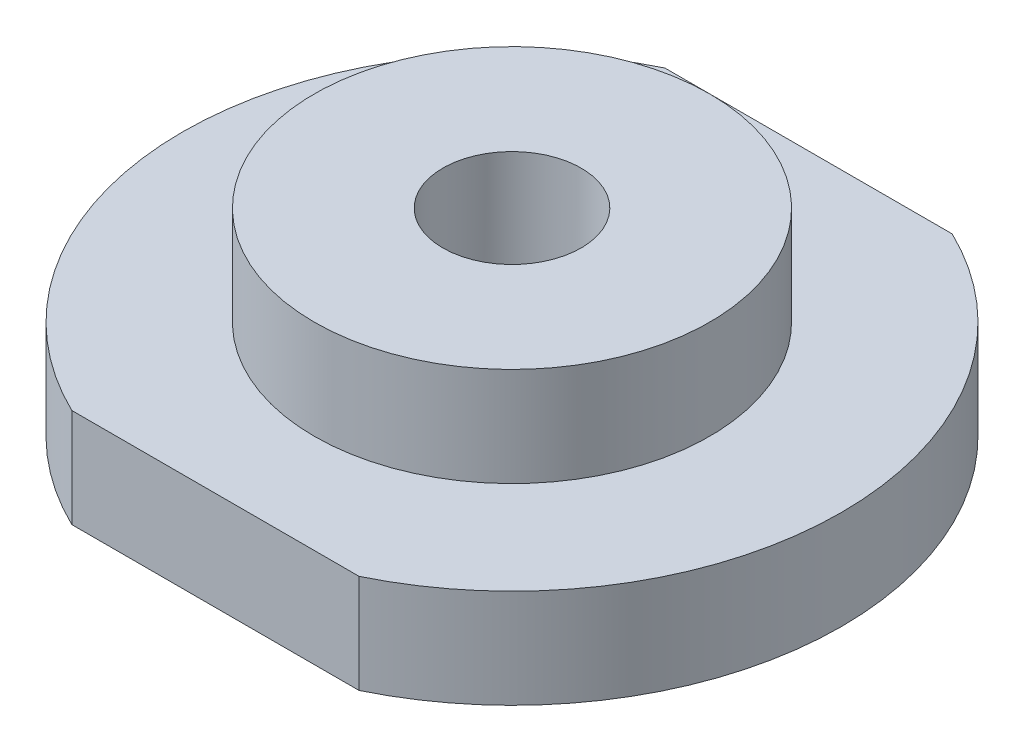
ISO-10303-21;
HEADER;
FILE_DESCRIPTION(('STEP AP214'),'2;1');
FILE_NAME('part.step','',(''),(''),'','','');
FILE_SCHEMA(('AUTOMOTIVE_DESIGN { 1 0 10303 214 1 1 1 1 }'));
ENDSEC;
DATA;
#1=APPLICATION_CONTEXT('core data for automotive mechanical design processes');
#2=APPLICATION_PROTOCOL_DEFINITION('international standard','automotive_design',2000,#1);
#3=PRODUCT_CONTEXT('',#1,'mechanical');
#4=PRODUCT('Part','Part','',(#3));
#5=PRODUCT_RELATED_PRODUCT_CATEGORY('part','',(#4));
#6=PRODUCT_DEFINITION_FORMATION('','',#4);
#7=PRODUCT_DEFINITION_CONTEXT('part definition',#1,'design');
#8=PRODUCT_DEFINITION('design','',#6,#7);
#9=PRODUCT_DEFINITION_SHAPE('','',#8);
#10=(LENGTH_UNIT() NAMED_UNIT(*) SI_UNIT(.MILLI.,.METRE.));
#11=(NAMED_UNIT(*) PLANE_ANGLE_UNIT() SI_UNIT($,.RADIAN.));
#12=(NAMED_UNIT(*) SI_UNIT($,.STERADIAN.) SOLID_ANGLE_UNIT());
#13=UNCERTAINTY_MEASURE_WITH_UNIT(LENGTH_MEASURE(1.E-05),#10,'distance_accuracy_value','');
#14=(GEOMETRIC_REPRESENTATION_CONTEXT(3) GLOBAL_UNCERTAINTY_ASSIGNED_CONTEXT((#13)) GLOBAL_UNIT_ASSIGNED_CONTEXT((#10,
#11,#12)) REPRESENTATION_CONTEXT('',''));
#15=CARTESIAN_POINT('',(0.,0.,0.));
#16=DIRECTION('',(0.,0.,1.));
#17=DIRECTION('',(1.,0.,0.));
#18=AXIS2_PLACEMENT_3D('',#15,#16,#17);
#19=CARTESIAN_POINT('',(0.,8.,0.));
#20=DIRECTION('',(0.,-1.,0.));
#21=DIRECTION('',(0.,0.,-1.));
#22=AXIS2_PLACEMENT_3D('',#19,#20,#21);
#23=CYLINDRICAL_SURFACE('',#22,10.);
#24=CARTESIAN_POINT('',(0.,3.,0.));
#25=DIRECTION('',(0.,1.,0.));
#26=DIRECTION('',(0.,0.,1.));
#27=AXIS2_PLACEMENT_3D('',#24,#25,#26);
#28=CIRCLE('',#27,10.);
#29=CARTESIAN_POINT('',(4.35889894354067,3.,9.));
#30=VERTEX_POINT('',#29);
#31=CARTESIAN_POINT('',(4.35889894354067,3.,-9.));
#32=VERTEX_POINT('',#31);
#33=EDGE_CURVE('E138',#30,#32,#28,.T.);
#34=ORIENTED_EDGE('',*,*,#33,.F.);
#35=DIRECTION('',(0.,-1.,0.));
#36=VECTOR('',#35,1.);
#37=CARTESIAN_POINT('',(4.35889894354067,10.,9.));
#38=LINE('',#37,#36);
#39=CARTESIAN_POINT('',(4.35889894354067,0.,9.));
#40=VERTEX_POINT('',#39);
#41=EDGE_CURVE('E63',#30,#40,#38,.T.);
#42=ORIENTED_EDGE('',*,*,#41,.T.);
#43=CARTESIAN_POINT('',(0.,0.,0.));
#44=DIRECTION('',(0.,1.,0.));
#45=DIRECTION('',(0.,0.,1.));
#46=AXIS2_PLACEMENT_3D('',#43,#44,#45);
#47=CIRCLE('',#46,10.);
#48=CARTESIAN_POINT('',(4.35889894354067,0.,-9.));
#49=VERTEX_POINT('',#48);
#50=EDGE_CURVE('E132',#40,#49,#47,.T.);
#51=ORIENTED_EDGE('',*,*,#50,.T.);
#52=DIRECTION('',(0.,-1.,0.));
#53=VECTOR('',#52,1.);
#54=CARTESIAN_POINT('',(4.35889894354067,10.,-9.));
#55=LINE('',#54,#53);
#56=EDGE_CURVE('E134',#32,#49,#55,.T.);
#57=ORIENTED_EDGE('',*,*,#56,.F.);
#58=EDGE_LOOP('',(#34,#42,#51,#57));
#59=FACE_BOUND('',#58,.T.);
#60=ADVANCED_FACE('F41',(#59),#23,.T.);
#61=CARTESIAN_POINT('',(-4.35889894354067,0.,-9.));
#62=VERTEX_POINT('',#61);
#63=CARTESIAN_POINT('',(-4.35889894354067,0.,9.));
#64=VERTEX_POINT('',#63);
#65=EDGE_CURVE('E130',#62,#64,#47,.T.);
#66=ORIENTED_EDGE('',*,*,#65,.T.);
#67=DIRECTION('',(0.,-1.,0.));
#68=VECTOR('',#67,1.);
#69=CARTESIAN_POINT('',(-4.35889894354067,10.,9.));
#70=LINE('',#69,#68);
#71=CARTESIAN_POINT('',(-4.35889894354067,3.,9.));
#72=VERTEX_POINT('',#71);
#73=EDGE_CURVE('E115',#72,#64,#70,.T.);
#74=ORIENTED_EDGE('',*,*,#73,.F.);
#75=CARTESIAN_POINT('',(-4.35889894354067,3.,-9.));
#76=VERTEX_POINT('',#75);
#77=EDGE_CURVE('E143',#76,#72,#28,.T.);
#78=ORIENTED_EDGE('',*,*,#77,.F.);
#79=DIRECTION('',(0.,-1.,0.));
#80=VECTOR('',#79,1.);
#81=CARTESIAN_POINT('',(-4.35889894354067,10.,-9.));
#82=LINE('',#81,#80);
#83=EDGE_CURVE('E56',#76,#62,#82,.T.);
#84=ORIENTED_EDGE('',*,*,#83,.T.);
#85=EDGE_LOOP('',(#66,#74,#78,#84));
#86=FACE_BOUND('',#85,.T.);
#87=ADVANCED_FACE('F136',(#86),#23,.T.);
#88=CARTESIAN_POINT('',(0.,0.,0.));
#89=DIRECTION('',(0.,1.,0.));
#90=DIRECTION('',(0.,0.,1.));
#91=AXIS2_PLACEMENT_3D('',#88,#89,#90);
#92=PLANE('',#91);
#93=DIRECTION('',(-0.874157276121538,0.,0.485642931178632));
#94=VECTOR('',#93,1.);
#95=CARTESIAN_POINT('',(-1.74056603773585,0.,-3.13301886792453));
#96=LINE('',#95,#94);
#97=CARTESIAN_POINT('',(0.,0.,-4.1));
#98=VERTEX_POINT('',#97);
#99=CARTESIAN_POINT('',(-3.6,0.,-2.1));
#100=VERTEX_POINT('',#99);
#101=EDGE_CURVE('E218',#98,#100,#96,.T.);
#102=ORIENTED_EDGE('',*,*,#101,.T.);
#103=DIRECTION('',(0.,0.,-1.));
#104=VECTOR('',#103,1.);
#105=CARTESIAN_POINT('',(-3.6,0.,0.));
#106=LINE('',#105,#104);
#107=CARTESIAN_POINT('',(-3.6,0.,2.1));
#108=VERTEX_POINT('',#107);
#109=EDGE_CURVE('E221',#108,#100,#106,.T.);
#110=ORIENTED_EDGE('',*,*,#109,.F.);
#111=DIRECTION('',(-0.874157276121538,0.,-0.485642931178632));
#112=VECTOR('',#111,1.);
#113=CARTESIAN_POINT('',(-1.74056603773585,0.,3.13301886792453));
#114=LINE('',#113,#112);
#115=CARTESIAN_POINT('',(0.,0.,4.1));
#116=VERTEX_POINT('',#115);
#117=EDGE_CURVE('E225',#116,#108,#114,.T.);
#118=ORIENTED_EDGE('',*,*,#117,.F.);
#119=DIRECTION('',(-0.874157276121538,0.,0.485642931178632));
#120=VECTOR('',#119,1.);
#121=CARTESIAN_POINT('',(1.74056603773585,0.,3.13301886792453));
#122=LINE('',#121,#120);
#123=CARTESIAN_POINT('',(3.6,0.,2.1));
#124=VERTEX_POINT('',#123);
#125=EDGE_CURVE('E229',#124,#116,#122,.T.);
#126=ORIENTED_EDGE('',*,*,#125,.F.);
#127=DIRECTION('',(0.,0.,-1.));
#128=VECTOR('',#127,1.);
#129=CARTESIAN_POINT('',(3.6,0.,0.));
#130=LINE('',#129,#128);
#131=CARTESIAN_POINT('',(3.6,0.,-2.1));
#132=VERTEX_POINT('',#131);
#133=EDGE_CURVE('E176',#124,#132,#130,.T.);
#134=ORIENTED_EDGE('',*,*,#133,.T.);
#135=DIRECTION('',(-0.874157276121538,0.,-0.485642931178632));
#136=VECTOR('',#135,1.);
#137=CARTESIAN_POINT('',(1.74056603773585,0.,-3.13301886792453));
#138=LINE('',#137,#136);
#139=EDGE_CURVE('E171',#132,#98,#138,.T.);
#140=ORIENTED_EDGE('',*,*,#139,.T.);
#141=EDGE_LOOP('',(#102,#110,#118,#126,#134,#140));
#142=FACE_BOUND('',#141,.T.);
#143=ORIENTED_EDGE('',*,*,#50,.F.);
#144=DIRECTION('',(1.,0.,0.));
#145=VECTOR('',#144,1.);
#146=CARTESIAN_POINT('',(0.,0.,9.));
#147=LINE('',#146,#145);
#148=EDGE_CURVE('E118',#64,#40,#147,.T.);
#149=ORIENTED_EDGE('',*,*,#148,.F.);
#150=ORIENTED_EDGE('',*,*,#65,.F.);
#151=DIRECTION('',(1.,0.,0.));
#152=VECTOR('',#151,1.);
#153=CARTESIAN_POINT('',(0.,0.,-9.));
#154=LINE('',#153,#152);
#155=EDGE_CURVE('E239',#62,#49,#154,.T.);
#156=ORIENTED_EDGE('',*,*,#155,.T.);
#157=EDGE_LOOP('',(#143,#149,#150,#156));
#158=FACE_BOUND('',#157,.T.);
#159=ADVANCED_FACE('F128',(#142,#158),#92,.F.);
#160=CARTESIAN_POINT('',(0.,3.,0.));
#161=DIRECTION('',(0.,1.,0.));
#162=DIRECTION('',(0.,0.,1.));
#163=AXIS2_PLACEMENT_3D('',#160,#161,#162);
#164=PLANE('',#163);
#165=DIRECTION('',(-1.,0.,0.));
#166=VECTOR('',#165,1.);
#167=CARTESIAN_POINT('',(0.,3.,9.));
#168=LINE('',#167,#166);
#169=EDGE_CURVE('E11',#30,#72,#168,.T.);
#170=ORIENTED_EDGE('',*,*,#169,.F.);
#171=ORIENTED_EDGE('',*,*,#33,.T.);
#172=DIRECTION('',(-1.,0.,0.));
#173=VECTOR('',#172,1.);
#174=CARTESIAN_POINT('',(0.,3.,-9.));
#175=LINE('',#174,#173);
#176=EDGE_CURVE('E49',#32,#76,#175,.T.);
#177=ORIENTED_EDGE('',*,*,#176,.T.);
#178=ORIENTED_EDGE('',*,*,#77,.T.);
#179=EDGE_LOOP('',(#170,#171,#177,#178));
#180=FACE_BOUND('',#179,.T.);
#181=CARTESIAN_POINT('',(0.,3.,0.));
#182=DIRECTION('',(0.,1.,0.));
#183=DIRECTION('',(0.,0.,1.));
#184=AXIS2_PLACEMENT_3D('',#181,#182,#183);
#185=CIRCLE('',#184,6.);
#186=CARTESIAN_POINT('',(0.,3.,6.));
#187=VERTEX_POINT('',#186);
#188=EDGE_CURVE('E150',#187,#187,#185,.T.);
#189=ORIENTED_EDGE('',*,*,#188,.F.);
#190=EDGE_LOOP('',(#189));
#191=FACE_BOUND('',#190,.T.);
#192=ADVANCED_FACE('F154',(#180,#191),#164,.T.);
#193=CARTESIAN_POINT('',(0.,-3.,0.));
#194=DIRECTION('',(0.,1.,0.));
#195=DIRECTION('',(0.,0.,1.));
#196=AXIS2_PLACEMENT_3D('',#193,#194,#195);
#197=CYLINDRICAL_SURFACE('',#196,2.1);
#198=CARTESIAN_POINT('',(0.,2.,0.));
#199=DIRECTION('',(0.,-1.,0.));
#200=DIRECTION('',(0.,0.,-1.));
#201=AXIS2_PLACEMENT_3D('',#198,#199,#200);
#202=CIRCLE('',#201,2.1);
#203=CARTESIAN_POINT('',(0.,2.,-2.1));
#204=VERTEX_POINT('',#203);
#205=EDGE_CURVE('E147',#204,#204,#202,.F.);
#206=ORIENTED_EDGE('',*,*,#205,.F.);
#207=EDGE_LOOP('',(#206));
#208=FACE_BOUND('',#207,.T.);
#209=CARTESIAN_POINT('',(0.,6.,0.));
#210=DIRECTION('',(0.,1.,0.));
#211=DIRECTION('',(0.,0.,1.));
#212=AXIS2_PLACEMENT_3D('',#209,#210,#211);
#213=CIRCLE('',#212,2.1);
#214=CARTESIAN_POINT('',(0.,6.,2.1));
#215=VERTEX_POINT('',#214);
#216=EDGE_CURVE('E151',#215,#215,#213,.F.);
#217=ORIENTED_EDGE('',*,*,#216,.F.);
#218=EDGE_LOOP('',(#217));
#219=FACE_BOUND('',#218,.T.);
#220=ADVANCED_FACE('F270',(#208,#219),#197,.F.);
#221=CARTESIAN_POINT('',(0.,3.,0.));
#222=DIRECTION('',(0.,1.,0.));
#223=DIRECTION('',(0.,0.,1.));
#224=AXIS2_PLACEMENT_3D('',#221,#222,#223);
#225=CYLINDRICAL_SURFACE('',#224,6.);
#226=ORIENTED_EDGE('',*,*,#188,.T.);
#227=EDGE_LOOP('',(#226));
#228=FACE_BOUND('',#227,.T.);
#229=CARTESIAN_POINT('',(0.,6.,0.));
#230=DIRECTION('',(0.,1.,0.));
#231=DIRECTION('',(0.,0.,1.));
#232=AXIS2_PLACEMENT_3D('',#229,#230,#231);
#233=CIRCLE('',#232,6.);
#234=CARTESIAN_POINT('',(0.,6.,6.));
#235=VERTEX_POINT('',#234);
#236=EDGE_CURVE('E167',#235,#235,#233,.T.);
#237=ORIENTED_EDGE('',*,*,#236,.F.);
#238=EDGE_LOOP('',(#237));
#239=FACE_BOUND('',#238,.T.);
#240=ADVANCED_FACE('F273',(#228,#239),#225,.T.);
#241=CARTESIAN_POINT('',(0.,2.,0.));
#242=DIRECTION('',(0.,-1.,0.));
#243=DIRECTION('',(0.,0.,-1.));
#244=AXIS2_PLACEMENT_3D('',#241,#242,#243);
#245=PLANE('',#244);
#246=DIRECTION('',(0.874157276121538,0.,0.485642931178632));
#247=VECTOR('',#246,1.);
#248=CARTESIAN_POINT('',(1.74056603773585,2.,-3.13301886792453));
#249=LINE('',#248,#247);
#250=CARTESIAN_POINT('',(0.,2.,-4.1));
#251=VERTEX_POINT('',#250);
#252=CARTESIAN_POINT('',(3.6,2.,-2.1));
#253=VERTEX_POINT('',#252);
#254=EDGE_CURVE('E197',#251,#253,#249,.T.);
#255=ORIENTED_EDGE('',*,*,#254,.T.);
#256=DIRECTION('',(0.,0.,1.));
#257=VECTOR('',#256,1.);
#258=CARTESIAN_POINT('',(3.6,2.,0.));
#259=LINE('',#258,#257);
#260=CARTESIAN_POINT('',(3.6,2.,2.1));
#261=VERTEX_POINT('',#260);
#262=EDGE_CURVE('E200',#253,#261,#259,.T.);
#263=ORIENTED_EDGE('',*,*,#262,.T.);
#264=DIRECTION('',(0.874157276121538,0.,-0.485642931178632));
#265=VECTOR('',#264,1.);
#266=CARTESIAN_POINT('',(1.74056603773585,2.,3.13301886792453));
#267=LINE('',#266,#265);
#268=CARTESIAN_POINT('',(0.,2.,4.1));
#269=VERTEX_POINT('',#268);
#270=EDGE_CURVE('E203',#269,#261,#267,.T.);
#271=ORIENTED_EDGE('',*,*,#270,.F.);
#272=DIRECTION('',(0.874157276121538,0.,0.485642931178632));
#273=VECTOR('',#272,1.);
#274=CARTESIAN_POINT('',(-1.74056603773585,2.,3.13301886792453));
#275=LINE('',#274,#273);
#276=CARTESIAN_POINT('',(-3.6,2.,2.1));
#277=VERTEX_POINT('',#276);
#278=EDGE_CURVE('E207',#277,#269,#275,.T.);
#279=ORIENTED_EDGE('',*,*,#278,.F.);
#280=DIRECTION('',(0.,0.,1.));
#281=VECTOR('',#280,1.);
#282=CARTESIAN_POINT('',(-3.6,2.,0.));
#283=LINE('',#282,#281);
#284=CARTESIAN_POINT('',(-3.6,2.,-2.1));
#285=VERTEX_POINT('',#284);
#286=EDGE_CURVE('E211',#285,#277,#283,.T.);
#287=ORIENTED_EDGE('',*,*,#286,.F.);
#288=DIRECTION('',(0.874157276121538,0.,-0.485642931178632));
#289=VECTOR('',#288,1.);
#290=CARTESIAN_POINT('',(-1.74056603773585,2.,-3.13301886792453));
#291=LINE('',#290,#289);
#292=EDGE_CURVE('E215',#285,#251,#291,.T.);
#293=ORIENTED_EDGE('',*,*,#292,.T.);
#294=EDGE_LOOP('',(#255,#263,#271,#279,#287,#293));
#295=FACE_BOUND('',#294,.T.);
#296=ORIENTED_EDGE('',*,*,#205,.T.);
#297=EDGE_LOOP('',(#296));
#298=FACE_BOUND('',#297,.T.);
#299=ADVANCED_FACE('F276',(#295,#298),#245,.T.);
#300=CARTESIAN_POINT('',(0.,6.,0.));
#301=DIRECTION('',(0.,1.,0.));
#302=DIRECTION('',(0.,0.,1.));
#303=AXIS2_PLACEMENT_3D('',#300,#301,#302);
#304=PLANE('',#303);
#305=ORIENTED_EDGE('',*,*,#236,.T.);
#306=EDGE_LOOP('',(#305));
#307=FACE_BOUND('',#306,.T.);
#308=ORIENTED_EDGE('',*,*,#216,.T.);
#309=EDGE_LOOP('',(#308));
#310=FACE_BOUND('',#309,.T.);
#311=ADVANCED_FACE('F282',(#307,#310),#304,.T.);
#312=CARTESIAN_POINT('',(1.74056603773585,-18.3847763108502,-3.13301886792453));
#313=DIRECTION('',(-0.485642931178632,0.,0.874157276121538));
#314=DIRECTION('',(0.874157276121538,0.,0.485642931178632));
#315=AXIS2_PLACEMENT_3D('',#312,#313,#314);
#316=PLANE('',#315);
#317=ORIENTED_EDGE('',*,*,#139,.F.);
#318=DIRECTION('',(0.,1.,0.));
#319=VECTOR('',#318,1.);
#320=CARTESIAN_POINT('',(3.6,-18.3847763108502,-2.1));
#321=LINE('',#320,#319);
#322=EDGE_CURVE('E189',#132,#253,#321,.T.);
#323=ORIENTED_EDGE('',*,*,#322,.T.);
#324=ORIENTED_EDGE('',*,*,#254,.F.);
#325=DIRECTION('',(0.,1.,0.));
#326=VECTOR('',#325,1.);
#327=CARTESIAN_POINT('',(0.,-18.3847763108502,-4.1));
#328=LINE('',#327,#326);
#329=EDGE_CURVE('E193',#98,#251,#328,.T.);
#330=ORIENTED_EDGE('',*,*,#329,.F.);
#331=EDGE_LOOP('',(#317,#323,#324,#330));
#332=FACE_BOUND('',#331,.T.);
#333=ADVANCED_FACE('F285',(#332),#316,.T.);
#334=CARTESIAN_POINT('',(3.6,-18.3847763108502,0.));
#335=DIRECTION('',(-1.,0.,0.));
#336=DIRECTION('',(0.,0.,1.));
#337=AXIS2_PLACEMENT_3D('',#334,#335,#336);
#338=PLANE('',#337);
#339=ORIENTED_EDGE('',*,*,#133,.F.);
#340=DIRECTION('',(0.,1.,0.));
#341=VECTOR('',#340,1.);
#342=CARTESIAN_POINT('',(3.6,-18.3847763108502,2.1));
#343=LINE('',#342,#341);
#344=EDGE_CURVE('E185',#124,#261,#343,.T.);
#345=ORIENTED_EDGE('',*,*,#344,.T.);
#346=ORIENTED_EDGE('',*,*,#262,.F.);
#347=ORIENTED_EDGE('',*,*,#322,.F.);
#348=EDGE_LOOP('',(#339,#345,#346,#347));
#349=FACE_BOUND('',#348,.T.);
#350=ADVANCED_FACE('F298',(#349),#338,.T.);
#351=CARTESIAN_POINT('',(1.74056603773585,-18.3847763108502,3.13301886792453));
#352=DIRECTION('',(0.485642931178632,0.,0.874157276121538));
#353=DIRECTION('',(0.874157276121538,0.,-0.485642931178632));
#354=AXIS2_PLACEMENT_3D('',#351,#352,#353);
#355=PLANE('',#354);
#356=ORIENTED_EDGE('',*,*,#344,.F.);
#357=ORIENTED_EDGE('',*,*,#125,.T.);
#358=DIRECTION('',(0.,1.,0.));
#359=VECTOR('',#358,1.);
#360=CARTESIAN_POINT('',(0.,-18.3847763108502,4.1));
#361=LINE('',#360,#359);
#362=EDGE_CURVE('E181',#116,#269,#361,.T.);
#363=ORIENTED_EDGE('',*,*,#362,.T.);
#364=ORIENTED_EDGE('',*,*,#270,.T.);
#365=EDGE_LOOP('',(#356,#357,#363,#364));
#366=FACE_BOUND('',#365,.T.);
#367=ADVANCED_FACE('F294',(#366),#355,.F.);
#368=CARTESIAN_POINT('',(-1.74056603773585,-18.3847763108502,3.13301886792453));
#369=DIRECTION('',(-0.485642931178632,0.,0.874157276121538));
#370=DIRECTION('',(0.874157276121538,0.,0.485642931178632));
#371=AXIS2_PLACEMENT_3D('',#368,#369,#370);
#372=PLANE('',#371);
#373=ORIENTED_EDGE('',*,*,#362,.F.);
#374=ORIENTED_EDGE('',*,*,#117,.T.);
#375=DIRECTION('',(0.,1.,0.));
#376=VECTOR('',#375,1.);
#377=CARTESIAN_POINT('',(-3.6,-18.3847763108502,2.1));
#378=LINE('',#377,#376);
#379=EDGE_CURVE('E177',#108,#277,#378,.T.);
#380=ORIENTED_EDGE('',*,*,#379,.T.);
#381=ORIENTED_EDGE('',*,*,#278,.T.);
#382=EDGE_LOOP('',(#373,#374,#380,#381));
#383=FACE_BOUND('',#382,.T.);
#384=ADVANCED_FACE('F290',(#383),#372,.F.);
#385=CARTESIAN_POINT('',(-3.6,-18.3847763108502,0.));
#386=DIRECTION('',(-1.,0.,0.));
#387=DIRECTION('',(0.,0.,1.));
#388=AXIS2_PLACEMENT_3D('',#385,#386,#387);
#389=PLANE('',#388);
#390=ORIENTED_EDGE('',*,*,#379,.F.);
#391=ORIENTED_EDGE('',*,*,#109,.T.);
#392=DIRECTION('',(0.,1.,0.));
#393=VECTOR('',#392,1.);
#394=CARTESIAN_POINT('',(-3.6,-18.3847763108502,-2.1));
#395=LINE('',#394,#393);
#396=EDGE_CURVE('E172',#100,#285,#395,.T.);
#397=ORIENTED_EDGE('',*,*,#396,.T.);
#398=ORIENTED_EDGE('',*,*,#286,.T.);
#399=EDGE_LOOP('',(#390,#391,#397,#398));
#400=FACE_BOUND('',#399,.T.);
#401=ADVANCED_FACE('F255',(#400),#389,.F.);
#402=CARTESIAN_POINT('',(-1.74056603773585,-18.3847763108502,-3.13301886792453));
#403=DIRECTION('',(0.485642931178632,0.,0.874157276121538));
#404=DIRECTION('',(0.874157276121538,0.,-0.485642931178632));
#405=AXIS2_PLACEMENT_3D('',#402,#403,#404);
#406=PLANE('',#405);
#407=ORIENTED_EDGE('',*,*,#101,.F.);
#408=ORIENTED_EDGE('',*,*,#329,.T.);
#409=ORIENTED_EDGE('',*,*,#292,.F.);
#410=ORIENTED_EDGE('',*,*,#396,.F.);
#411=EDGE_LOOP('',(#407,#408,#409,#410));
#412=FACE_BOUND('',#411,.T.);
#413=ADVANCED_FACE('F248',(#412),#406,.T.);
#414=CARTESIAN_POINT('',(0.,10.,-9.));
#415=DIRECTION('',(0.,0.,-1.));
#416=DIRECTION('',(-1.,0.,0.));
#417=AXIS2_PLACEMENT_3D('',#414,#415,#416);
#418=PLANE('',#417);
#419=ORIENTED_EDGE('',*,*,#56,.T.);
#420=ORIENTED_EDGE('',*,*,#155,.F.);
#421=ORIENTED_EDGE('',*,*,#83,.F.);
#422=ORIENTED_EDGE('',*,*,#176,.F.);
#423=EDGE_LOOP('',(#419,#420,#421,#422));
#424=FACE_BOUND('',#423,.T.);
#425=ADVANCED_FACE('F246',(#424),#418,.T.);
#426=CARTESIAN_POINT('',(0.,10.,9.));
#427=DIRECTION('',(0.,0.,-1.));
#428=DIRECTION('',(-1.,0.,0.));
#429=AXIS2_PLACEMENT_3D('',#426,#427,#428);
#430=PLANE('',#429);
#431=ORIENTED_EDGE('',*,*,#169,.T.);
#432=ORIENTED_EDGE('',*,*,#73,.T.);
#433=ORIENTED_EDGE('',*,*,#148,.T.);
#434=ORIENTED_EDGE('',*,*,#41,.F.);
#435=EDGE_LOOP('',(#431,#432,#433,#434));
#436=FACE_BOUND('',#435,.T.);
#437=ADVANCED_FACE('F117',(#436),#430,.F.);
#438=CLOSED_SHELL('',(#60,#87,#159,#192,#220,#240,#299,#311,#333,#350,#367,#384,#401,#413,#425,#437));
#439=MANIFOLD_SOLID_BREP('B2',#438);
#440=ADVANCED_BREP_SHAPE_REPRESENTATION('',(#18,#439),#14);
#441=SHAPE_DEFINITION_REPRESENTATION(#9,#440);
ENDSEC;
END-ISO-10303-21;
